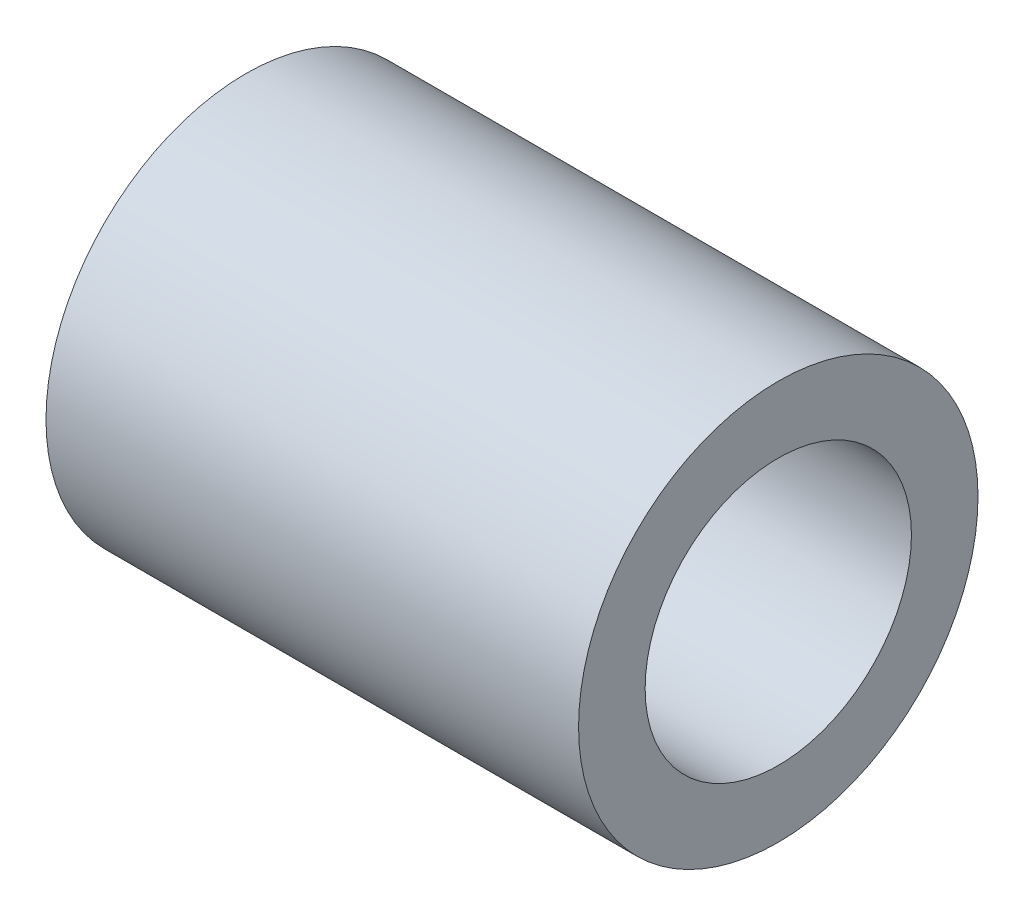
ISO-10303-21;
HEADER;
FILE_DESCRIPTION(('STEP AP214'),'2;1');
FILE_NAME('part.step','',(''),(''),'','','');
FILE_SCHEMA(('AUTOMOTIVE_DESIGN { 1 0 10303 214 1 1 1 1 }'));
ENDSEC;
DATA;
#1=APPLICATION_CONTEXT('core data for automotive mechanical design processes');
#2=APPLICATION_PROTOCOL_DEFINITION('international standard','automotive_design',2000,#1);
#3=PRODUCT_CONTEXT('',#1,'mechanical');
#4=PRODUCT('Part','Part','',(#3));
#5=PRODUCT_RELATED_PRODUCT_CATEGORY('part','',(#4));
#6=PRODUCT_DEFINITION_FORMATION('','',#4);
#7=PRODUCT_DEFINITION_CONTEXT('part definition',#1,'design');
#8=PRODUCT_DEFINITION('design','',#6,#7);
#9=PRODUCT_DEFINITION_SHAPE('','',#8);
#10=(LENGTH_UNIT() NAMED_UNIT(*) SI_UNIT(.MILLI.,.METRE.));
#11=(NAMED_UNIT(*) PLANE_ANGLE_UNIT() SI_UNIT($,.RADIAN.));
#12=(NAMED_UNIT(*) SI_UNIT($,.STERADIAN.) SOLID_ANGLE_UNIT());
#13=UNCERTAINTY_MEASURE_WITH_UNIT(LENGTH_MEASURE(1.E-05),#10,'distance_accuracy_value','');
#14=(GEOMETRIC_REPRESENTATION_CONTEXT(3) GLOBAL_UNCERTAINTY_ASSIGNED_CONTEXT((#13)) GLOBAL_UNIT_ASSIGNED_CONTEXT((#10,
#11,#12)) REPRESENTATION_CONTEXT('',''));
#15=CARTESIAN_POINT('',(0.,0.,0.));
#16=DIRECTION('',(0.,0.,1.));
#17=DIRECTION('',(1.,0.,0.));
#18=AXIS2_PLACEMENT_3D('',#15,#16,#17);
#19=CARTESIAN_POINT('',(50.,0.,0.));
#20=DIRECTION('',(1.,0.,0.));
#21=DIRECTION('',(0.,0.,-1.));
#22=AXIS2_PLACEMENT_3D('',#19,#20,#21);
#23=PLANE('',#22);
#24=CARTESIAN_POINT('',(50.,0.,0.));
#25=DIRECTION('',(1.,0.,0.));
#26=DIRECTION('',(0.,0.,-1.));
#27=AXIS2_PLACEMENT_3D('',#24,#25,#26);
#28=CIRCLE('',#27,37.5);
#29=CARTESIAN_POINT('',(50.,0.,-37.5));
#30=VERTEX_POINT('',#29);
#31=EDGE_CURVE('E10',#30,#30,#28,.T.);
#32=ORIENTED_EDGE('',*,*,#31,.T.);
#33=EDGE_LOOP('',(#32));
#34=FACE_BOUND('',#33,.T.);
#35=CARTESIAN_POINT('',(50.,0.,0.));
#36=DIRECTION('',(1.,0.,0.));
#37=DIRECTION('',(0.,0.,-1.));
#38=AXIS2_PLACEMENT_3D('',#35,#36,#37);
#39=CIRCLE('',#38,25.);
#40=CARTESIAN_POINT('',(50.,0.,-25.));
#41=VERTEX_POINT('',#40);
#42=EDGE_CURVE('E42',#41,#41,#39,.T.);
#43=ORIENTED_EDGE('',*,*,#42,.F.);
#44=EDGE_LOOP('',(#43));
#45=FACE_BOUND('',#44,.T.);
#46=ADVANCED_FACE('F31',(#34,#45),#23,.T.);
#47=CARTESIAN_POINT('',(-50.,0.,0.));
#48=DIRECTION('',(1.,0.,0.));
#49=DIRECTION('',(0.,0.,-1.));
#50=AXIS2_PLACEMENT_3D('',#47,#48,#49);
#51=PLANE('',#50);
#52=CARTESIAN_POINT('',(-50.,0.,0.));
#53=DIRECTION('',(1.,0.,0.));
#54=DIRECTION('',(0.,0.,-1.));
#55=AXIS2_PLACEMENT_3D('',#52,#53,#54);
#56=CIRCLE('',#55,37.5);
#57=CARTESIAN_POINT('',(-50.,0.,-37.5));
#58=VERTEX_POINT('',#57);
#59=EDGE_CURVE('E35',#58,#58,#56,.T.);
#60=ORIENTED_EDGE('',*,*,#59,.F.);
#61=EDGE_LOOP('',(#60));
#62=FACE_BOUND('',#61,.T.);
#63=CARTESIAN_POINT('',(-50.,0.,0.));
#64=DIRECTION('',(1.,0.,0.));
#65=DIRECTION('',(0.,0.,-1.));
#66=AXIS2_PLACEMENT_3D('',#63,#64,#65);
#67=CIRCLE('',#66,25.);
#68=CARTESIAN_POINT('',(-50.,0.,-25.));
#69=VERTEX_POINT('',#68);
#70=EDGE_CURVE('E44',#69,#69,#67,.T.);
#71=ORIENTED_EDGE('',*,*,#70,.T.);
#72=EDGE_LOOP('',(#71));
#73=FACE_BOUND('',#72,.T.);
#74=ADVANCED_FACE('F54',(#62,#73),#51,.F.);
#75=CARTESIAN_POINT('',(50.,0.,0.));
#76=DIRECTION('',(-1.,0.,0.));
#77=DIRECTION('',(0.,0.,1.));
#78=AXIS2_PLACEMENT_3D('',#75,#76,#77);
#79=CYLINDRICAL_SURFACE('',#78,37.5);
#80=ORIENTED_EDGE('',*,*,#31,.F.);
#81=EDGE_LOOP('',(#80));
#82=FACE_BOUND('',#81,.T.);
#83=ORIENTED_EDGE('',*,*,#59,.T.);
#84=EDGE_LOOP('',(#83));
#85=FACE_BOUND('',#84,.T.);
#86=ADVANCED_FACE('F33',(#82,#85),#79,.T.);
#87=CARTESIAN_POINT('',(50.,0.,0.));
#88=DIRECTION('',(-1.,0.,0.));
#89=DIRECTION('',(0.,0.,1.));
#90=AXIS2_PLACEMENT_3D('',#87,#88,#89);
#91=CYLINDRICAL_SURFACE('',#90,25.);
#92=ORIENTED_EDGE('',*,*,#42,.T.);
#93=EDGE_LOOP('',(#92));
#94=FACE_BOUND('',#93,.T.);
#95=ORIENTED_EDGE('',*,*,#70,.F.);
#96=EDGE_LOOP('',(#95));
#97=FACE_BOUND('',#96,.T.);
#98=ADVANCED_FACE('F50',(#94,#97),#91,.F.);
#99=CLOSED_SHELL('',(#46,#74,#86,#98));
#100=MANIFOLD_SOLID_BREP('B2',#99);
#101=ADVANCED_BREP_SHAPE_REPRESENTATION('',(#18,#100),#14);
#102=SHAPE_DEFINITION_REPRESENTATION(#9,#101);
ENDSEC;
END-ISO-10303-21;
